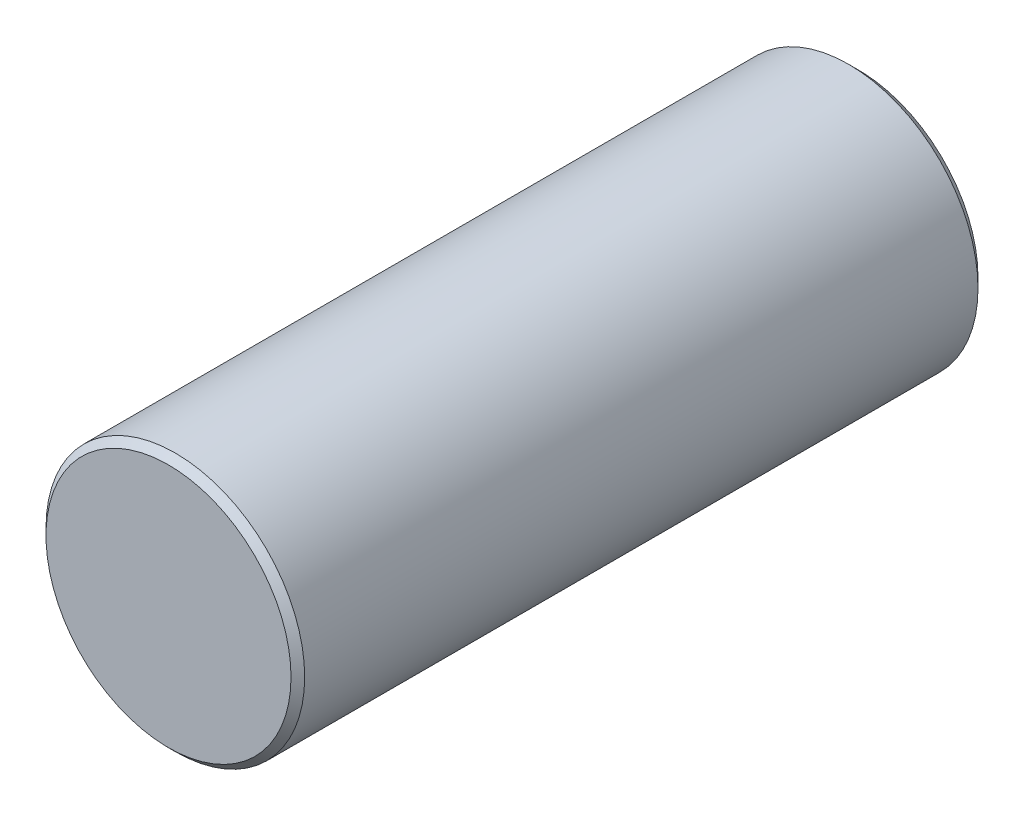
ISO-10303-21;
HEADER;
FILE_DESCRIPTION(('STEP AP214'),'2;1');
FILE_NAME('part.step','',(''),(''),'','','');
FILE_SCHEMA(('AUTOMOTIVE_DESIGN { 1 0 10303 214 1 1 1 1 }'));
ENDSEC;
DATA;
#1=APPLICATION_CONTEXT('core data for automotive mechanical design processes');
#2=APPLICATION_PROTOCOL_DEFINITION('international standard','automotive_design',2000,#1);
#3=PRODUCT_CONTEXT('',#1,'mechanical');
#4=PRODUCT('Part','Part','',(#3));
#5=PRODUCT_RELATED_PRODUCT_CATEGORY('part','',(#4));
#6=PRODUCT_DEFINITION_FORMATION('','',#4);
#7=PRODUCT_DEFINITION_CONTEXT('part definition',#1,'design');
#8=PRODUCT_DEFINITION('design','',#6,#7);
#9=PRODUCT_DEFINITION_SHAPE('','',#8);
#10=(LENGTH_UNIT() NAMED_UNIT(*) SI_UNIT(.MILLI.,.METRE.));
#11=(NAMED_UNIT(*) PLANE_ANGLE_UNIT() SI_UNIT($,.RADIAN.));
#12=(NAMED_UNIT(*) SI_UNIT($,.STERADIAN.) SOLID_ANGLE_UNIT());
#13=UNCERTAINTY_MEASURE_WITH_UNIT(LENGTH_MEASURE(1.E-05),#10,'distance_accuracy_value','');
#14=(GEOMETRIC_REPRESENTATION_CONTEXT(3) GLOBAL_UNCERTAINTY_ASSIGNED_CONTEXT((#13)) GLOBAL_UNIT_ASSIGNED_CONTEXT((#10,
#11,#12)) REPRESENTATION_CONTEXT('',''));
#15=CARTESIAN_POINT('',(0.,0.,0.));
#16=DIRECTION('',(0.,0.,1.));
#17=DIRECTION('',(1.,0.,0.));
#18=AXIS2_PLACEMENT_3D('',#15,#16,#17);
#19=CARTESIAN_POINT('',(0.,0.,12.7));
#20=DIRECTION('',(0.,0.,-1.));
#21=DIRECTION('',(-1.,0.,0.));
#22=AXIS2_PLACEMENT_3D('',#19,#20,#21);
#23=PLANE('',#22);
#24=CARTESIAN_POINT('',(0.,0.,12.7));
#25=DIRECTION('',(0.,0.,1.));
#26=DIRECTION('',(1.,0.,0.));
#27=AXIS2_PLACEMENT_3D('',#24,#25,#26);
#28=CIRCLE('',#27,4.5110528286101);
#29=CARTESIAN_POINT('',(4.5110528286101,0.,12.7));
#30=VERTEX_POINT('',#29);
#31=EDGE_CURVE('E10',#30,#30,#28,.T.);
#32=ORIENTED_EDGE('',*,*,#31,.T.);
#33=EDGE_LOOP('',(#32));
#34=FACE_BOUND('',#33,.T.);
#35=ADVANCED_FACE('F33',(#34),#23,.F.);
#36=CARTESIAN_POINT('',(0.,0.,12.44855282861));
#37=DIRECTION('',(0.,0.,-1.));
#38=DIRECTION('',(-1.,0.,0.));
#39=AXIS2_PLACEMENT_3D('',#36,#37,#38);
#40=CONICAL_SURFACE('',#39,4.7625,0.785398163397247);
#41=ORIENTED_EDGE('',*,*,#31,.F.);
#42=EDGE_LOOP('',(#41));
#43=FACE_BOUND('',#42,.T.);
#44=CARTESIAN_POINT('',(0.,0.,12.44855282861));
#45=DIRECTION('',(0.,0.,1.));
#46=DIRECTION('',(1.,0.,0.));
#47=AXIS2_PLACEMENT_3D('',#44,#45,#46);
#48=CIRCLE('',#47,4.7625);
#49=CARTESIAN_POINT('',(4.7625,0.,12.44855282861));
#50=VERTEX_POINT('',#49);
#51=EDGE_CURVE('E39',#50,#50,#48,.T.);
#52=ORIENTED_EDGE('',*,*,#51,.T.);
#53=EDGE_LOOP('',(#52));
#54=FACE_BOUND('',#53,.T.);
#55=ADVANCED_FACE('F65',(#43,#54),#40,.T.);
#56=CARTESIAN_POINT('',(0.,0.,-12.7));
#57=DIRECTION('',(0.,0.,1.));
#58=DIRECTION('',(1.,0.,0.));
#59=AXIS2_PLACEMENT_3D('',#56,#57,#58);
#60=CYLINDRICAL_SURFACE('',#59,4.7625);
#61=ORIENTED_EDGE('',*,*,#51,.F.);
#62=EDGE_LOOP('',(#61));
#63=FACE_BOUND('',#62,.T.);
#64=CARTESIAN_POINT('',(0.,0.,-12.3444));
#65=DIRECTION('',(0.,0.,1.));
#66=DIRECTION('',(1.,0.,0.));
#67=AXIS2_PLACEMENT_3D('',#64,#65,#66);
#68=CIRCLE('',#67,4.7625);
#69=CARTESIAN_POINT('',(4.7625,0.,-12.3444));
#70=VERTEX_POINT('',#69);
#71=EDGE_CURVE('E43',#70,#70,#68,.T.);
#72=ORIENTED_EDGE('',*,*,#71,.T.);
#73=EDGE_LOOP('',(#72));
#74=FACE_BOUND('',#73,.T.);
#75=ADVANCED_FACE('F61',(#63,#74),#60,.T.);
#76=CARTESIAN_POINT('',(0.,0.,-12.7));
#77=DIRECTION('',(0.,0.,1.));
#78=DIRECTION('',(1.,0.,0.));
#79=AXIS2_PLACEMENT_3D('',#76,#77,#78);
#80=CONICAL_SURFACE('',#79,4.4069,0.78539816339745);
#81=ORIENTED_EDGE('',*,*,#71,.F.);
#82=EDGE_LOOP('',(#81));
#83=FACE_BOUND('',#82,.T.);
#84=CARTESIAN_POINT('',(0.,0.,-12.7));
#85=DIRECTION('',(0.,0.,1.));
#86=DIRECTION('',(1.,0.,0.));
#87=AXIS2_PLACEMENT_3D('',#84,#85,#86);
#88=CIRCLE('',#87,4.4069);
#89=CARTESIAN_POINT('',(4.4069,0.,-12.7));
#90=VERTEX_POINT('',#89);
#91=EDGE_CURVE('E47',#90,#90,#88,.T.);
#92=ORIENTED_EDGE('',*,*,#91,.T.);
#93=EDGE_LOOP('',(#92));
#94=FACE_BOUND('',#93,.T.);
#95=ADVANCED_FACE('F53',(#83,#94),#80,.T.);
#96=CARTESIAN_POINT('',(0.,4.4069,-12.7));
#97=DIRECTION('',(0.,0.,1.));
#98=DIRECTION('',(1.,0.,0.));
#99=AXIS2_PLACEMENT_3D('',#96,#97,#98);
#100=PLANE('',#99);
#101=ORIENTED_EDGE('',*,*,#91,.F.);
#102=EDGE_LOOP('',(#101));
#103=FACE_BOUND('',#102,.T.);
#104=ADVANCED_FACE('F55',(#103),#100,.F.);
#105=CLOSED_SHELL('',(#35,#55,#75,#95,#104));
#106=MANIFOLD_SOLID_BREP('B2',#105);
#107=ADVANCED_BREP_SHAPE_REPRESENTATION('',(#18,#106),#14);
#108=SHAPE_DEFINITION_REPRESENTATION(#9,#107);
ENDSEC;
END-ISO-10303-21;
